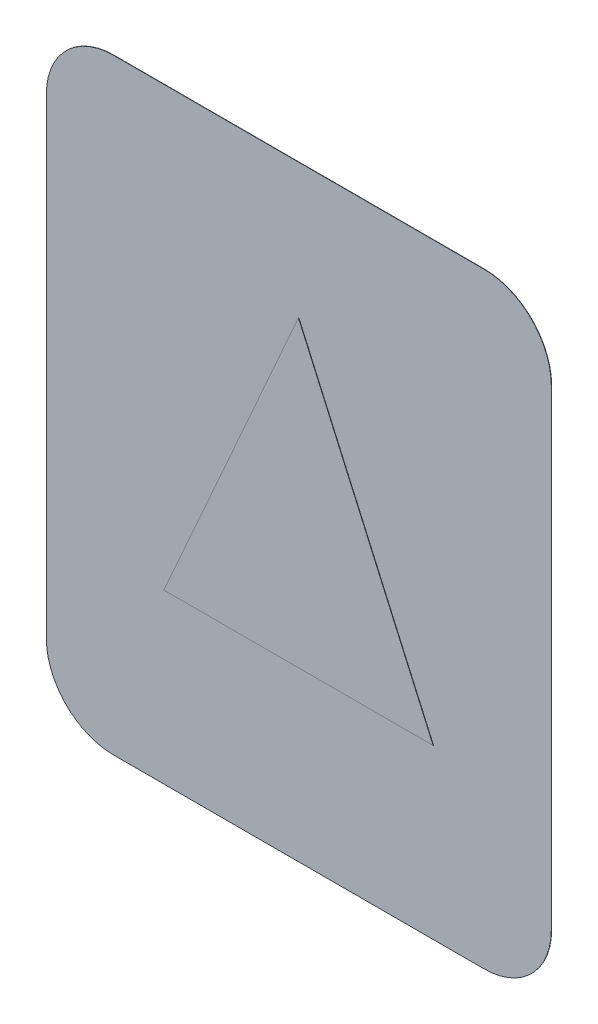
ISO-10303-21;
HEADER;
FILE_DESCRIPTION(('STEP AP214'),'2;1');
FILE_NAME('part.step','',(''),(''),'','','');
FILE_SCHEMA(('AUTOMOTIVE_DESIGN { 1 0 10303 214 1 1 1 1 }'));
ENDSEC;
DATA;
#1=APPLICATION_CONTEXT('core data for automotive mechanical design processes');
#2=APPLICATION_PROTOCOL_DEFINITION('international standard','automotive_design',2000,#1);
#3=PRODUCT_CONTEXT('',#1,'mechanical');
#4=PRODUCT('Part','Part','',(#3));
#5=PRODUCT_RELATED_PRODUCT_CATEGORY('part','',(#4));
#6=PRODUCT_DEFINITION_FORMATION('','',#4);
#7=PRODUCT_DEFINITION_CONTEXT('part definition',#1,'design');
#8=PRODUCT_DEFINITION('design','',#6,#7);
#9=PRODUCT_DEFINITION_SHAPE('','',#8);
#10=(LENGTH_UNIT() NAMED_UNIT(*) SI_UNIT(.MILLI.,.METRE.));
#11=(NAMED_UNIT(*) PLANE_ANGLE_UNIT() SI_UNIT($,.RADIAN.));
#12=(NAMED_UNIT(*) SI_UNIT($,.STERADIAN.) SOLID_ANGLE_UNIT());
#13=UNCERTAINTY_MEASURE_WITH_UNIT(LENGTH_MEASURE(1.E-05),#10,'distance_accuracy_value','');
#14=(GEOMETRIC_REPRESENTATION_CONTEXT(3) GLOBAL_UNCERTAINTY_ASSIGNED_CONTEXT((#13)) GLOBAL_UNIT_ASSIGNED_CONTEXT((#10,
#11,#12)) REPRESENTATION_CONTEXT('',''));
#15=CARTESIAN_POINT('',(0.,0.,0.));
#16=DIRECTION('',(0.,0.,1.));
#17=DIRECTION('',(1.,0.,0.));
#18=AXIS2_PLACEMENT_3D('',#15,#16,#17);
#19=CARTESIAN_POINT('',(-47.7083333333333,54.7395833333333,0.1));
#20=DIRECTION('',(0.,0.,-1.));
#21=DIRECTION('',(-1.,0.,0.));
#22=AXIS2_PLACEMENT_3D('',#19,#20,#21);
#23=PLANE('',#22);
#24=CARTESIAN_POINT('',(-47.7083333333333,54.7395833333333,0.1));
#25=DIRECTION('',(0.,0.,-1.));
#26=DIRECTION('',(-1.,0.,0.));
#27=AXIS2_PLACEMENT_3D('',#24,#25,#26);
#28=CIRCLE('',#27,20.);
#29=CARTESIAN_POINT('',(-67.7083333333333,54.7395833333332,0.1));
#30=VERTEX_POINT('',#29);
#31=CARTESIAN_POINT('',(-47.7083333333332,74.7395833333333,0.1));
#32=VERTEX_POINT('',#31);
#33=EDGE_CURVE('E144',#30,#32,#28,.T.);
#34=ORIENTED_EDGE('',*,*,#33,.F.);
#35=DIRECTION('',(0.,-1.,0.));
#36=VECTOR('',#35,1.);
#37=CARTESIAN_POINT('',(-67.7083333333333,54.7395833333332,0.1));
#38=LINE('',#37,#36);
#39=CARTESIAN_POINT('',(-67.7083333333333,-85.2604166666665,0.1));
#40=VERTEX_POINT('',#39);
#41=EDGE_CURVE('E162',#30,#40,#38,.T.);
#42=ORIENTED_EDGE('',*,*,#41,.T.);
#43=CARTESIAN_POINT('',(-47.7083333333333,-85.2604166666667,0.1));
#44=DIRECTION('',(0.,0.,1.));
#45=DIRECTION('',(1.,0.,0.));
#46=AXIS2_PLACEMENT_3D('',#43,#44,#45);
#47=CIRCLE('',#46,20.);
#48=CARTESIAN_POINT('',(-47.7083333333331,-105.260416666667,0.1));
#49=VERTEX_POINT('',#48);
#50=EDGE_CURVE('E160',#40,#49,#47,.T.);
#51=ORIENTED_EDGE('',*,*,#50,.T.);
#52=DIRECTION('',(1.,0.,0.));
#53=VECTOR('',#52,1.);
#54=CARTESIAN_POINT('',(-47.7083333333331,-105.260416666667,0.1));
#55=LINE('',#54,#53);
#56=CARTESIAN_POINT('',(62.2916666666666,-105.260416666667,0.1));
#57=VERTEX_POINT('',#56);
#58=EDGE_CURVE('E158',#49,#57,#55,.T.);
#59=ORIENTED_EDGE('',*,*,#58,.T.);
#60=CARTESIAN_POINT('',(62.2916666666667,-85.2604166666667,0.1));
#61=DIRECTION('',(0.,0.,1.));
#62=DIRECTION('',(1.,0.,0.));
#63=AXIS2_PLACEMENT_3D('',#60,#61,#62);
#64=CIRCLE('',#63,20.);
#65=CARTESIAN_POINT('',(82.2916666666667,-85.2604166666665,0.1));
#66=VERTEX_POINT('',#65);
#67=EDGE_CURVE('E156',#57,#66,#64,.T.);
#68=ORIENTED_EDGE('',*,*,#67,.T.);
#69=DIRECTION('',(0.,-1.,0.));
#70=VECTOR('',#69,1.);
#71=CARTESIAN_POINT('',(82.2916666666667,54.7395833333332,0.1));
#72=LINE('',#71,#70);
#73=CARTESIAN_POINT('',(82.2916666666667,54.7395833333332,0.1));
#74=VERTEX_POINT('',#73);
#75=EDGE_CURVE('E153',#74,#66,#72,.T.);
#76=ORIENTED_EDGE('',*,*,#75,.F.);
#77=CARTESIAN_POINT('',(62.2916666666667,54.7395833333333,0.1));
#78=DIRECTION('',(0.,0.,1.));
#79=DIRECTION('',(1.,0.,0.));
#80=AXIS2_PLACEMENT_3D('',#77,#78,#79);
#81=CIRCLE('',#80,20.);
#82=CARTESIAN_POINT('',(62.2916666666665,74.7395833333333,0.1));
#83=VERTEX_POINT('',#82);
#84=EDGE_CURVE('E151',#74,#83,#81,.T.);
#85=ORIENTED_EDGE('',*,*,#84,.T.);
#86=DIRECTION('',(1.,0.,0.));
#87=VECTOR('',#86,1.);
#88=CARTESIAN_POINT('',(-47.7083333333332,74.7395833333333,0.1));
#89=LINE('',#88,#87);
#90=EDGE_CURVE('E147',#32,#83,#89,.T.);
#91=ORIENTED_EDGE('',*,*,#90,.F.);
#92=EDGE_LOOP('',(#34,#42,#51,#59,#68,#76,#85,#91));
#93=FACE_BOUND('',#92,.T.);
#94=DIRECTION('',(1.,0.,0.));
#95=VECTOR('',#94,1.);
#96=CARTESIAN_POINT('',(47.2916666666667,-55.2604166666667,0.1));
#97=LINE('',#96,#95);
#98=CARTESIAN_POINT('',(-32.7083333333333,-55.2604166666667,0.1));
#99=VERTEX_POINT('',#98);
#100=CARTESIAN_POINT('',(47.2916666666667,-55.2604166666667,0.1));
#101=VERTEX_POINT('',#100);
#102=EDGE_CURVE('E134',#99,#101,#97,.T.);
#103=ORIENTED_EDGE('',*,*,#102,.F.);
#104=DIRECTION('',(-0.406138466053448,-0.913811548620257,0.));
#105=VECTOR('',#104,1.);
#106=CARTESIAN_POINT('',(-32.7083333333333,-55.2604166666667,0.1));
#107=LINE('',#106,#105);
#108=CARTESIAN_POINT('',(7.29166666666669,34.7395833333333,0.1));
#109=VERTEX_POINT('',#108);
#110=EDGE_CURVE('E54',#109,#99,#107,.T.);
#111=ORIENTED_EDGE('',*,*,#110,.F.);
#112=DIRECTION('',(-0.406138466053448,0.913811548620257,0.));
#113=VECTOR('',#112,1.);
#114=CARTESIAN_POINT('',(7.29166666666668,34.7395833333333,0.1));
#115=LINE('',#114,#113);
#116=EDGE_CURVE('E50',#101,#109,#115,.T.);
#117=ORIENTED_EDGE('',*,*,#116,.F.);
#118=EDGE_LOOP('',(#103,#111,#117));
#119=FACE_BOUND('',#118,.T.);
#120=ADVANCED_FACE('F33',(#93,#119),#23,.F.);
#121=CARTESIAN_POINT('',(-47.7083333333333,54.7395833333333,0.1));
#122=DIRECTION('',(0.,0.,-1.));
#123=DIRECTION('',(-1.,0.,0.));
#124=AXIS2_PLACEMENT_3D('',#121,#122,#123);
#125=CYLINDRICAL_SURFACE('',#124,20.);
#126=CARTESIAN_POINT('',(-47.7083333333333,54.7395833333333,0.));
#127=DIRECTION('',(0.,0.,-1.));
#128=DIRECTION('',(-1.,0.,0.));
#129=AXIS2_PLACEMENT_3D('',#126,#127,#128);
#130=CIRCLE('',#129,20.);
#131=CARTESIAN_POINT('',(-67.7083333333333,54.7395833333332,0.));
#132=VERTEX_POINT('',#131);
#133=CARTESIAN_POINT('',(-47.7083333333332,74.7395833333333,0.));
#134=VERTEX_POINT('',#133);
#135=EDGE_CURVE('E135',#132,#134,#130,.T.);
#136=ORIENTED_EDGE('',*,*,#135,.F.);
#137=DIRECTION('',(0.,0.,-1.));
#138=VECTOR('',#137,1.);
#139=CARTESIAN_POINT('',(-67.7083333333333,54.7395833333332,0.1));
#140=LINE('',#139,#138);
#141=EDGE_CURVE('E11',#30,#132,#140,.T.);
#142=ORIENTED_EDGE('',*,*,#141,.F.);
#143=ORIENTED_EDGE('',*,*,#33,.T.);
#144=DIRECTION('',(0.,0.,-1.));
#145=VECTOR('',#144,1.);
#146=CARTESIAN_POINT('',(-47.7083333333332,74.7395833333333,0.1));
#147=LINE('',#146,#145);
#148=EDGE_CURVE('E37',#32,#134,#147,.T.);
#149=ORIENTED_EDGE('',*,*,#148,.T.);
#150=EDGE_LOOP('',(#136,#142,#143,#149));
#151=FACE_BOUND('',#150,.T.);
#152=ADVANCED_FACE('F35',(#151),#125,.T.);
#153=CARTESIAN_POINT('',(-67.7083333333333,54.7395833333332,0.1));
#154=DIRECTION('',(1.,0.,0.));
#155=DIRECTION('',(0.,1.,0.));
#156=AXIS2_PLACEMENT_3D('',#153,#154,#155);
#157=PLANE('',#156);
#158=DIRECTION('',(0.,-1.,0.));
#159=VECTOR('',#158,1.);
#160=CARTESIAN_POINT('',(-67.7083333333333,54.7395833333332,0.));
#161=LINE('',#160,#159);
#162=CARTESIAN_POINT('',(-67.7083333333333,-85.2604166666665,0.));
#163=VERTEX_POINT('',#162);
#164=EDGE_CURVE('E148',#132,#163,#161,.T.);
#165=ORIENTED_EDGE('',*,*,#164,.T.);
#166=DIRECTION('',(0.,0.,-1.));
#167=VECTOR('',#166,1.);
#168=CARTESIAN_POINT('',(-67.7083333333333,-85.2604166666665,0.1));
#169=LINE('',#168,#167);
#170=EDGE_CURVE('E42',#40,#163,#169,.T.);
#171=ORIENTED_EDGE('',*,*,#170,.F.);
#172=ORIENTED_EDGE('',*,*,#41,.F.);
#173=ORIENTED_EDGE('',*,*,#141,.T.);
#174=EDGE_LOOP('',(#165,#171,#172,#173));
#175=FACE_BOUND('',#174,.T.);
#176=ADVANCED_FACE('F208',(#175),#157,.F.);
#177=CARTESIAN_POINT('',(-47.7083333333333,-85.2604166666667,0.1));
#178=DIRECTION('',(0.,0.,-1.));
#179=DIRECTION('',(-1.,0.,0.));
#180=AXIS2_PLACEMENT_3D('',#177,#178,#179);
#181=CYLINDRICAL_SURFACE('',#180,20.);
#182=CARTESIAN_POINT('',(-47.7083333333333,-85.2604166666667,0.));
#183=DIRECTION('',(0.,0.,1.));
#184=DIRECTION('',(1.,0.,0.));
#185=AXIS2_PLACEMENT_3D('',#182,#183,#184);
#186=CIRCLE('',#185,20.);
#187=CARTESIAN_POINT('',(-47.7083333333331,-105.260416666667,0.));
#188=VERTEX_POINT('',#187);
#189=EDGE_CURVE('E177',#163,#188,#186,.T.);
#190=ORIENTED_EDGE('',*,*,#189,.T.);
#191=DIRECTION('',(0.,0.,-1.));
#192=VECTOR('',#191,1.);
#193=CARTESIAN_POINT('',(-47.7083333333331,-105.260416666667,0.1));
#194=LINE('',#193,#192);
#195=EDGE_CURVE('E182',#49,#188,#194,.T.);
#196=ORIENTED_EDGE('',*,*,#195,.F.);
#197=ORIENTED_EDGE('',*,*,#50,.F.);
#198=ORIENTED_EDGE('',*,*,#170,.T.);
#199=EDGE_LOOP('',(#190,#196,#197,#198));
#200=FACE_BOUND('',#199,.T.);
#201=ADVANCED_FACE('F212',(#200),#181,.T.);
#202=CARTESIAN_POINT('',(-47.7083333333331,-105.260416666667,0.1));
#203=DIRECTION('',(0.,1.,0.));
#204=DIRECTION('',(0.,0.,1.));
#205=AXIS2_PLACEMENT_3D('',#202,#203,#204);
#206=PLANE('',#205);
#207=DIRECTION('',(1.,0.,0.));
#208=VECTOR('',#207,1.);
#209=CARTESIAN_POINT('',(-47.7083333333331,-105.260416666667,0.));
#210=LINE('',#209,#208);
#211=CARTESIAN_POINT('',(62.2916666666666,-105.260416666667,0.));
#212=VERTEX_POINT('',#211);
#213=EDGE_CURVE('E175',#188,#212,#210,.T.);
#214=ORIENTED_EDGE('',*,*,#213,.T.);
#215=DIRECTION('',(0.,0.,-1.));
#216=VECTOR('',#215,1.);
#217=CARTESIAN_POINT('',(62.2916666666666,-105.260416666667,0.1));
#218=LINE('',#217,#216);
#219=EDGE_CURVE('E185',#57,#212,#218,.T.);
#220=ORIENTED_EDGE('',*,*,#219,.F.);
#221=ORIENTED_EDGE('',*,*,#58,.F.);
#222=ORIENTED_EDGE('',*,*,#195,.T.);
#223=EDGE_LOOP('',(#214,#220,#221,#222));
#224=FACE_BOUND('',#223,.T.);
#225=ADVANCED_FACE('F230',(#224),#206,.F.);
#226=CARTESIAN_POINT('',(62.2916666666667,-85.2604166666667,0.1));
#227=DIRECTION('',(0.,0.,-1.));
#228=DIRECTION('',(-1.,0.,0.));
#229=AXIS2_PLACEMENT_3D('',#226,#227,#228);
#230=CYLINDRICAL_SURFACE('',#229,20.);
#231=CARTESIAN_POINT('',(62.2916666666667,-85.2604166666667,0.));
#232=DIRECTION('',(0.,0.,1.));
#233=DIRECTION('',(1.,0.,0.));
#234=AXIS2_PLACEMENT_3D('',#231,#232,#233);
#235=CIRCLE('',#234,20.);
#236=CARTESIAN_POINT('',(82.2916666666667,-85.2604166666665,0.));
#237=VERTEX_POINT('',#236);
#238=EDGE_CURVE('E172',#212,#237,#235,.T.);
#239=ORIENTED_EDGE('',*,*,#238,.T.);
#240=DIRECTION('',(0.,0.,-1.));
#241=VECTOR('',#240,1.);
#242=CARTESIAN_POINT('',(82.2916666666667,-85.2604166666665,0.1));
#243=LINE('',#242,#241);
#244=EDGE_CURVE('E188',#66,#237,#243,.T.);
#245=ORIENTED_EDGE('',*,*,#244,.F.);
#246=ORIENTED_EDGE('',*,*,#67,.F.);
#247=ORIENTED_EDGE('',*,*,#219,.T.);
#248=EDGE_LOOP('',(#239,#245,#246,#247));
#249=FACE_BOUND('',#248,.T.);
#250=ADVANCED_FACE('F228',(#249),#230,.T.);
#251=CARTESIAN_POINT('',(82.2916666666667,54.7395833333332,0.1));
#252=DIRECTION('',(1.,0.,0.));
#253=DIRECTION('',(0.,1.,0.));
#254=AXIS2_PLACEMENT_3D('',#251,#252,#253);
#255=PLANE('',#254);
#256=DIRECTION('',(0.,-1.,0.));
#257=VECTOR('',#256,1.);
#258=CARTESIAN_POINT('',(82.2916666666667,54.7395833333332,0.));
#259=LINE('',#258,#257);
#260=CARTESIAN_POINT('',(82.2916666666667,54.7395833333332,0.));
#261=VERTEX_POINT('',#260);
#262=EDGE_CURVE('E169',#261,#237,#259,.T.);
#263=ORIENTED_EDGE('',*,*,#262,.F.);
#264=DIRECTION('',(0.,0.,-1.));
#265=VECTOR('',#264,1.);
#266=CARTESIAN_POINT('',(82.2916666666667,54.7395833333332,0.1));
#267=LINE('',#266,#265);
#268=EDGE_CURVE('E190',#74,#261,#267,.T.);
#269=ORIENTED_EDGE('',*,*,#268,.F.);
#270=ORIENTED_EDGE('',*,*,#75,.T.);
#271=ORIENTED_EDGE('',*,*,#244,.T.);
#272=EDGE_LOOP('',(#263,#269,#270,#271));
#273=FACE_BOUND('',#272,.T.);
#274=ADVANCED_FACE('F224',(#273),#255,.T.);
#275=CARTESIAN_POINT('',(62.2916666666667,54.7395833333333,0.1));
#276=DIRECTION('',(0.,0.,-1.));
#277=DIRECTION('',(-1.,0.,0.));
#278=AXIS2_PLACEMENT_3D('',#275,#276,#277);
#279=CYLINDRICAL_SURFACE('',#278,20.);
#280=CARTESIAN_POINT('',(62.2916666666667,54.7395833333333,0.));
#281=DIRECTION('',(0.,0.,1.));
#282=DIRECTION('',(1.,0.,0.));
#283=AXIS2_PLACEMENT_3D('',#280,#281,#282);
#284=CIRCLE('',#283,20.);
#285=CARTESIAN_POINT('',(62.2916666666665,74.7395833333333,0.));
#286=VERTEX_POINT('',#285);
#287=EDGE_CURVE('E166',#261,#286,#284,.T.);
#288=ORIENTED_EDGE('',*,*,#287,.T.);
#289=DIRECTION('',(0.,0.,-1.));
#290=VECTOR('',#289,1.);
#291=CARTESIAN_POINT('',(62.2916666666665,74.7395833333333,0.1));
#292=LINE('',#291,#290);
#293=EDGE_CURVE('E191',#83,#286,#292,.T.);
#294=ORIENTED_EDGE('',*,*,#293,.F.);
#295=ORIENTED_EDGE('',*,*,#84,.F.);
#296=ORIENTED_EDGE('',*,*,#268,.T.);
#297=EDGE_LOOP('',(#288,#294,#295,#296));
#298=FACE_BOUND('',#297,.T.);
#299=ADVANCED_FACE('F220',(#298),#279,.T.);
#300=CARTESIAN_POINT('',(-47.7083333333332,74.7395833333333,0.1));
#301=DIRECTION('',(0.,1.,0.));
#302=DIRECTION('',(0.,0.,1.));
#303=AXIS2_PLACEMENT_3D('',#300,#301,#302);
#304=PLANE('',#303);
#305=DIRECTION('',(1.,0.,0.));
#306=VECTOR('',#305,1.);
#307=CARTESIAN_POINT('',(-47.7083333333332,74.7395833333333,0.));
#308=LINE('',#307,#306);
#309=EDGE_CURVE('E138',#134,#286,#308,.T.);
#310=ORIENTED_EDGE('',*,*,#309,.F.);
#311=ORIENTED_EDGE('',*,*,#148,.F.);
#312=ORIENTED_EDGE('',*,*,#90,.T.);
#313=ORIENTED_EDGE('',*,*,#293,.T.);
#314=EDGE_LOOP('',(#310,#311,#312,#313));
#315=FACE_BOUND('',#314,.T.);
#316=ADVANCED_FACE('F199',(#315),#304,.T.);
#317=CARTESIAN_POINT('',(-47.7083333333333,54.7395833333333,0.));
#318=DIRECTION('',(0.,0.,-1.));
#319=DIRECTION('',(-1.,0.,0.));
#320=AXIS2_PLACEMENT_3D('',#317,#318,#319);
#321=PLANE('',#320);
#322=ORIENTED_EDGE('',*,*,#135,.T.);
#323=ORIENTED_EDGE('',*,*,#309,.T.);
#324=ORIENTED_EDGE('',*,*,#287,.F.);
#325=ORIENTED_EDGE('',*,*,#262,.T.);
#326=ORIENTED_EDGE('',*,*,#238,.F.);
#327=ORIENTED_EDGE('',*,*,#213,.F.);
#328=ORIENTED_EDGE('',*,*,#189,.F.);
#329=ORIENTED_EDGE('',*,*,#164,.F.);
#330=EDGE_LOOP('',(#322,#323,#324,#325,#326,#327,#328,#329));
#331=FACE_BOUND('',#330,.T.);
#332=ADVANCED_FACE('F203',(#331),#321,.T.);
#333=CARTESIAN_POINT('',(47.2916666666667,-55.2604166666667,0.2));
#334=DIRECTION('',(0.,1.,0.));
#335=DIRECTION('',(-1.,0.,0.));
#336=AXIS2_PLACEMENT_3D('',#333,#334,#335);
#337=PLANE('',#336);
#338=ORIENTED_EDGE('',*,*,#102,.T.);
#339=DIRECTION('',(0.,0.,-1.));
#340=VECTOR('',#339,1.);
#341=CARTESIAN_POINT('',(47.2916666666667,-55.2604166666667,0.2));
#342=LINE('',#341,#340);
#343=CARTESIAN_POINT('',(47.2916666666667,-55.2604166666667,0.2));
#344=VERTEX_POINT('',#343);
#345=EDGE_CURVE('E118',#344,#101,#342,.T.);
#346=ORIENTED_EDGE('',*,*,#345,.F.);
#347=DIRECTION('',(1.,0.,0.));
#348=VECTOR('',#347,1.);
#349=CARTESIAN_POINT('',(47.2916666666667,-55.2604166666667,0.2));
#350=LINE('',#349,#348);
#351=CARTESIAN_POINT('',(-32.7083333333333,-55.2604166666667,0.2));
#352=VERTEX_POINT('',#351);
#353=EDGE_CURVE('E125',#352,#344,#350,.T.);
#354=ORIENTED_EDGE('',*,*,#353,.F.);
#355=DIRECTION('',(0.,0.,-1.));
#356=VECTOR('',#355,1.);
#357=CARTESIAN_POINT('',(-32.7083333333333,-55.2604166666667,0.2));
#358=LINE('',#357,#356);
#359=EDGE_CURVE('E140',#352,#99,#358,.T.);
#360=ORIENTED_EDGE('',*,*,#359,.T.);
#361=EDGE_LOOP('',(#338,#346,#354,#360));
#362=FACE_BOUND('',#361,.T.);
#363=ADVANCED_FACE('F133',(#362),#337,.F.);
#364=CARTESIAN_POINT('',(7.29166666666668,34.7395833333333,0.2));
#365=DIRECTION('',(-0.913811548620257,-0.406138466053448,0.));
#366=DIRECTION('',(0.406138466053448,-0.913811548620257,0.));
#367=AXIS2_PLACEMENT_3D('',#364,#365,#366);
#368=PLANE('',#367);
#369=ORIENTED_EDGE('',*,*,#116,.T.);
#370=DIRECTION('',(0.,0.,-1.));
#371=VECTOR('',#370,1.);
#372=CARTESIAN_POINT('',(7.29166666666668,34.7395833333333,0.2));
#373=LINE('',#372,#371);
#374=CARTESIAN_POINT('',(7.29166666666668,34.7395833333333,0.2));
#375=VERTEX_POINT('',#374);
#376=EDGE_CURVE('E121',#375,#109,#373,.T.);
#377=ORIENTED_EDGE('',*,*,#376,.F.);
#378=DIRECTION('',(-0.406138466053448,0.913811548620257,0.));
#379=VECTOR('',#378,1.);
#380=CARTESIAN_POINT('',(7.29166666666668,34.7395833333333,0.2));
#381=LINE('',#380,#379);
#382=EDGE_CURVE('E114',#344,#375,#381,.T.);
#383=ORIENTED_EDGE('',*,*,#382,.F.);
#384=ORIENTED_EDGE('',*,*,#345,.T.);
#385=EDGE_LOOP('',(#369,#377,#383,#384));
#386=FACE_BOUND('',#385,.T.);
#387=ADVANCED_FACE('F116',(#386),#368,.F.);
#388=CARTESIAN_POINT('',(-32.7083333333333,-55.2604166666667,0.2));
#389=DIRECTION('',(0.913811548620257,-0.406138466053448,0.));
#390=DIRECTION('',(0.406138466053448,0.913811548620257,0.));
#391=AXIS2_PLACEMENT_3D('',#388,#389,#390);
#392=PLANE('',#391);
#393=ORIENTED_EDGE('',*,*,#110,.T.);
#394=ORIENTED_EDGE('',*,*,#359,.F.);
#395=DIRECTION('',(-0.406138466053448,-0.913811548620257,0.));
#396=VECTOR('',#395,1.);
#397=CARTESIAN_POINT('',(-32.7083333333333,-55.2604166666667,0.2));
#398=LINE('',#397,#396);
#399=EDGE_CURVE('E124',#375,#352,#398,.T.);
#400=ORIENTED_EDGE('',*,*,#399,.F.);
#401=ORIENTED_EDGE('',*,*,#376,.T.);
#402=EDGE_LOOP('',(#393,#394,#400,#401));
#403=FACE_BOUND('',#402,.T.);
#404=ADVANCED_FACE('F317',(#403),#392,.F.);
#405=CARTESIAN_POINT('',(0.,0.,0.2));
#406=DIRECTION('',(0.,0.,-1.));
#407=DIRECTION('',(-1.,0.,0.));
#408=AXIS2_PLACEMENT_3D('',#405,#406,#407);
#409=PLANE('',#408);
#410=ORIENTED_EDGE('',*,*,#353,.T.);
#411=ORIENTED_EDGE('',*,*,#382,.T.);
#412=ORIENTED_EDGE('',*,*,#399,.T.);
#413=EDGE_LOOP('',(#410,#411,#412));
#414=FACE_BOUND('',#413,.T.);
#415=ADVANCED_FACE('F128',(#414),#409,.F.);
#416=CLOSED_SHELL('',(#120,#152,#176,#201,#225,#250,#274,#299,#316,#332,#363,#387,#404,#415));
#417=MANIFOLD_SOLID_BREP('B2',#416);
#418=ADVANCED_BREP_SHAPE_REPRESENTATION('',(#18,#417),#14);
#419=SHAPE_DEFINITION_REPRESENTATION(#9,#418);
ENDSEC;
END-ISO-10303-21;
